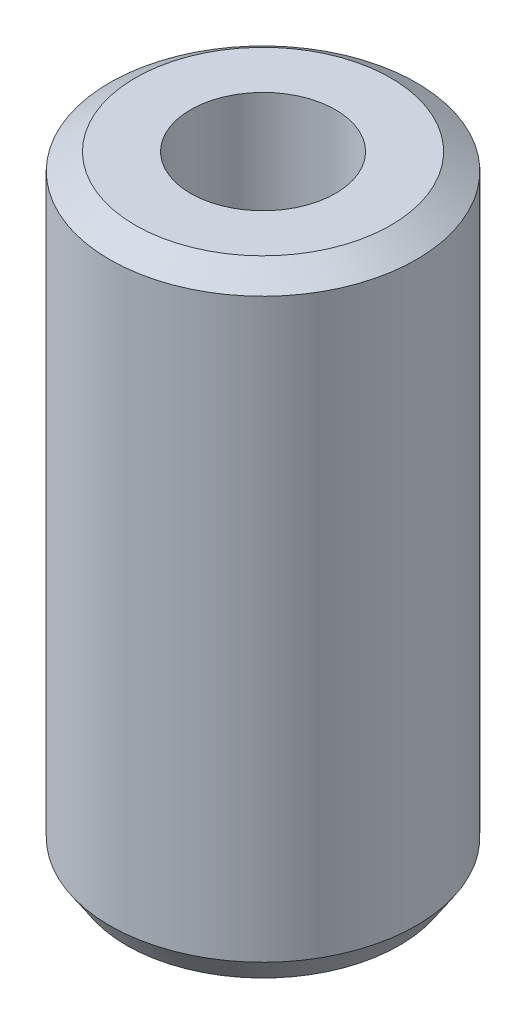
ISO-10303-21;
HEADER;
FILE_DESCRIPTION(('STEP AP214'),'2;1');
FILE_NAME('part.step','',(''),(''),'','','');
FILE_SCHEMA(('AUTOMOTIVE_DESIGN { 1 0 10303 214 1 1 1 1 }'));
ENDSEC;
DATA;
#1=APPLICATION_CONTEXT('core data for automotive mechanical design processes');
#2=APPLICATION_PROTOCOL_DEFINITION('international standard','automotive_design',2000,#1);
#3=PRODUCT_CONTEXT('',#1,'mechanical');
#4=PRODUCT('Part','Part','',(#3));
#5=PRODUCT_RELATED_PRODUCT_CATEGORY('part','',(#4));
#6=PRODUCT_DEFINITION_FORMATION('','',#4);
#7=PRODUCT_DEFINITION_CONTEXT('part definition',#1,'design');
#8=PRODUCT_DEFINITION('design','',#6,#7);
#9=PRODUCT_DEFINITION_SHAPE('','',#8);
#10=(LENGTH_UNIT() NAMED_UNIT(*) SI_UNIT(.MILLI.,.METRE.));
#11=(NAMED_UNIT(*) PLANE_ANGLE_UNIT() SI_UNIT($,.RADIAN.));
#12=(NAMED_UNIT(*) SI_UNIT($,.STERADIAN.) SOLID_ANGLE_UNIT());
#13=UNCERTAINTY_MEASURE_WITH_UNIT(LENGTH_MEASURE(1.E-05),#10,'distance_accuracy_value','');
#14=(GEOMETRIC_REPRESENTATION_CONTEXT(3) GLOBAL_UNCERTAINTY_ASSIGNED_CONTEXT((#13)) GLOBAL_UNIT_ASSIGNED_CONTEXT((#10,
#11,#12)) REPRESENTATION_CONTEXT('',''));
#15=CARTESIAN_POINT('',(0.,0.,0.));
#16=DIRECTION('',(0.,0.,1.));
#17=DIRECTION('',(1.,0.,0.));
#18=AXIS2_PLACEMENT_3D('',#15,#16,#17);
#19=CARTESIAN_POINT('',(0.,171.68169789655,0.));
#20=DIRECTION('',(0.,-1.,0.));
#21=DIRECTION('',(0.,0.,-1.));
#22=AXIS2_PLACEMENT_3D('',#19,#20,#21);
#23=CYLINDRICAL_SURFACE('',#22,42.5);
#24=CARTESIAN_POINT('',(0.,166.991713212011,0.));
#25=DIRECTION('',(0.,1.,0.));
#26=DIRECTION('',(0.,0.,1.));
#27=AXIS2_PLACEMENT_3D('',#24,#25,#26);
#28=CIRCLE('',#27,42.5);
#29=CARTESIAN_POINT('',(0.,166.991713212011,42.5));
#30=VERTEX_POINT('',#29);
#31=EDGE_CURVE('E50',#30,#30,#28,.F.);
#32=ORIENTED_EDGE('',*,*,#31,.T.);
#33=EDGE_LOOP('',(#32));
#34=FACE_BOUND('',#33,.T.);
#35=CARTESIAN_POINT('',(0.,7.09832996649884,0.));
#36=DIRECTION('',(0.,1.,0.));
#37=DIRECTION('',(0.,0.,1.));
#38=AXIS2_PLACEMENT_3D('',#35,#36,#37);
#39=CIRCLE('',#38,42.5);
#40=CARTESIAN_POINT('',(0.,7.09832996649884,42.5));
#41=VERTEX_POINT('',#40);
#42=EDGE_CURVE('E51',#41,#41,#39,.T.);
#43=ORIENTED_EDGE('',*,*,#42,.T.);
#44=EDGE_LOOP('',(#43));
#45=FACE_BOUND('',#44,.T.);
#46=ADVANCED_FACE('F39',(#34,#45),#23,.T.);
#47=CARTESIAN_POINT('',(0.,171.68169789655,0.));
#48=DIRECTION('',(0.,1.,0.));
#49=DIRECTION('',(0.,0.,1.));
#50=AXIS2_PLACEMENT_3D('',#47,#48,#49);
#51=PLANE('',#50);
#52=CARTESIAN_POINT('',(0.,171.68169789655,0.));
#53=DIRECTION('',(0.,1.,0.));
#54=DIRECTION('',(0.,0.,1.));
#55=AXIS2_PLACEMENT_3D('',#52,#53,#54);
#56=CIRCLE('',#55,35.4016700335011);
#57=CARTESIAN_POINT('',(0.,171.68169789655,35.4016700335011));
#58=VERTEX_POINT('',#57);
#59=EDGE_CURVE('E54',#58,#58,#56,.T.);
#60=ORIENTED_EDGE('',*,*,#59,.T.);
#61=EDGE_LOOP('',(#60));
#62=FACE_BOUND('',#61,.T.);
#63=CARTESIAN_POINT('',(0.,171.68169789655,0.));
#64=DIRECTION('',(0.,1.,0.));
#65=DIRECTION('',(0.,0.,1.));
#66=AXIS2_PLACEMENT_3D('',#63,#64,#65);
#67=CIRCLE('',#66,20.1031295079106);
#68=CARTESIAN_POINT('',(0.,171.68169789655,20.1031295079106));
#69=VERTEX_POINT('',#68);
#70=EDGE_CURVE('E58',#69,#69,#67,.T.);
#71=ORIENTED_EDGE('',*,*,#70,.F.);
#72=EDGE_LOOP('',(#71));
#73=FACE_BOUND('',#72,.T.);
#74=ADVANCED_FACE('F69',(#62,#73),#51,.T.);
#75=CARTESIAN_POINT('',(0.,0.,0.));
#76=DIRECTION('',(0.,1.,0.));
#77=DIRECTION('',(0.,0.,1.));
#78=AXIS2_PLACEMENT_3D('',#75,#76,#77);
#79=PLANE('',#78);
#80=CARTESIAN_POINT('',(0.,0.,0.));
#81=DIRECTION('',(0.,1.,0.));
#82=DIRECTION('',(0.,0.,1.));
#83=AXIS2_PLACEMENT_3D('',#80,#81,#82);
#84=CIRCLE('',#83,37.8100153154614);
#85=CARTESIAN_POINT('',(0.,0.,37.8100153154614));
#86=VERTEX_POINT('',#85);
#87=EDGE_CURVE('E10',#86,#86,#84,.F.);
#88=ORIENTED_EDGE('',*,*,#87,.T.);
#89=EDGE_LOOP('',(#88));
#90=FACE_BOUND('',#89,.T.);
#91=CARTESIAN_POINT('',(0.,0.,0.));
#92=DIRECTION('',(0.,1.,0.));
#93=DIRECTION('',(0.,0.,1.));
#94=AXIS2_PLACEMENT_3D('',#91,#92,#93);
#95=CIRCLE('',#94,20.1031295079106);
#96=CARTESIAN_POINT('',(0.,0.,20.1031295079106));
#97=VERTEX_POINT('',#96);
#98=EDGE_CURVE('E63',#97,#97,#95,.T.);
#99=ORIENTED_EDGE('',*,*,#98,.T.);
#100=EDGE_LOOP('',(#99));
#101=FACE_BOUND('',#100,.T.);
#102=ADVANCED_FACE('F75',(#90,#101),#79,.F.);
#103=CARTESIAN_POINT('',(0.,171.68169789655,0.));
#104=DIRECTION('',(0.,-1.,0.));
#105=DIRECTION('',(0.,0.,-1.));
#106=AXIS2_PLACEMENT_3D('',#103,#104,#105);
#107=CYLINDRICAL_SURFACE('',#106,20.1031295079106);
#108=ORIENTED_EDGE('',*,*,#70,.T.);
#109=EDGE_LOOP('',(#108));
#110=FACE_BOUND('',#109,.T.);
#111=ORIENTED_EDGE('',*,*,#98,.F.);
#112=EDGE_LOOP('',(#111));
#113=FACE_BOUND('',#112,.T.);
#114=ADVANCED_FACE('F70',(#110,#113),#107,.F.);
#115=CARTESIAN_POINT('',(0.,171.68169789655,0.));
#116=DIRECTION('',(0.,-1.,0.));
#117=DIRECTION('',(0.,0.,-1.));
#118=AXIS2_PLACEMENT_3D('',#115,#116,#117);
#119=CONICAL_SURFACE('',#118,35.4016700335011,0.986924296255383);
#120=ORIENTED_EDGE('',*,*,#31,.F.);
#121=EDGE_LOOP('',(#120));
#122=FACE_BOUND('',#121,.T.);
#123=ORIENTED_EDGE('',*,*,#59,.F.);
#124=EDGE_LOOP('',(#123));
#125=FACE_BOUND('',#124,.T.);
#126=ADVANCED_FACE('F81',(#122,#125),#119,.T.);
#127=CARTESIAN_POINT('',(0.,7.09832996649884,0.));
#128=DIRECTION('',(0.,1.,0.));
#129=DIRECTION('',(0.,0.,1.));
#130=AXIS2_PLACEMENT_3D('',#127,#128,#129);
#131=CONICAL_SURFACE('',#130,42.5,0.583872030539512);
#132=ORIENTED_EDGE('',*,*,#87,.F.);
#133=EDGE_LOOP('',(#132));
#134=FACE_BOUND('',#133,.T.);
#135=ORIENTED_EDGE('',*,*,#42,.F.);
#136=EDGE_LOOP('',(#135));
#137=FACE_BOUND('',#136,.T.);
#138=ADVANCED_FACE('F45',(#134,#137),#131,.T.);
#139=CLOSED_SHELL('',(#46,#74,#102,#114,#126,#138));
#140=MANIFOLD_SOLID_BREP('B2',#139);
#141=ADVANCED_BREP_SHAPE_REPRESENTATION('',(#18,#140),#14);
#142=SHAPE_DEFINITION_REPRESENTATION(#9,#141);
ENDSEC;
END-ISO-10303-21;
